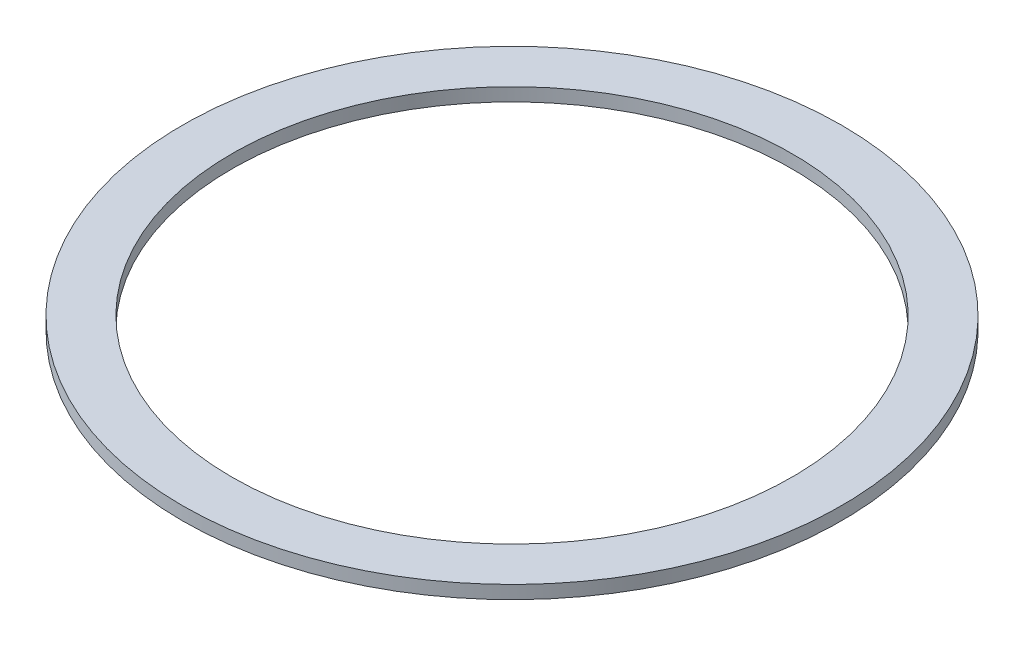
ISO-10303-21;
HEADER;
FILE_DESCRIPTION(('STEP AP214'),'2;1');
FILE_NAME('part.step','',(''),(''),'','','');
FILE_SCHEMA(('AUTOMOTIVE_DESIGN { 1 0 10303 214 1 1 1 1 }'));
ENDSEC;
DATA;
#1=APPLICATION_CONTEXT('core data for automotive mechanical design processes');
#2=APPLICATION_PROTOCOL_DEFINITION('international standard','automotive_design',2000,#1);
#3=PRODUCT_CONTEXT('',#1,'mechanical');
#4=PRODUCT('Part','Part','',(#3));
#5=PRODUCT_RELATED_PRODUCT_CATEGORY('part','',(#4));
#6=PRODUCT_DEFINITION_FORMATION('','',#4);
#7=PRODUCT_DEFINITION_CONTEXT('part definition',#1,'design');
#8=PRODUCT_DEFINITION('design','',#6,#7);
#9=PRODUCT_DEFINITION_SHAPE('','',#8);
#10=(LENGTH_UNIT() NAMED_UNIT(*) SI_UNIT(.MILLI.,.METRE.));
#11=(NAMED_UNIT(*) PLANE_ANGLE_UNIT() SI_UNIT($,.RADIAN.));
#12=(NAMED_UNIT(*) SI_UNIT($,.STERADIAN.) SOLID_ANGLE_UNIT());
#13=UNCERTAINTY_MEASURE_WITH_UNIT(LENGTH_MEASURE(1.E-05),#10,'distance_accuracy_value','');
#14=(GEOMETRIC_REPRESENTATION_CONTEXT(3) GLOBAL_UNCERTAINTY_ASSIGNED_CONTEXT((#13)) GLOBAL_UNIT_ASSIGNED_CONTEXT((#10,
#11,#12)) REPRESENTATION_CONTEXT('',''));
#15=CARTESIAN_POINT('',(0.,0.,0.));
#16=DIRECTION('',(0.,0.,1.));
#17=DIRECTION('',(1.,0.,0.));
#18=AXIS2_PLACEMENT_3D('',#15,#16,#17);
#19=CARTESIAN_POINT('',(0.,4.,0.));
#20=DIRECTION('',(0.,1.,0.));
#21=DIRECTION('',(0.,0.,1.));
#22=AXIS2_PLACEMENT_3D('',#19,#20,#21);
#23=PLANE('',#22);
#24=CARTESIAN_POINT('',(0.,4.,0.));
#25=DIRECTION('',(0.,1.,0.));
#26=DIRECTION('',(0.,0.,1.));
#27=AXIS2_PLACEMENT_3D('',#24,#25,#26);
#28=CIRCLE('',#27,100.);
#29=CARTESIAN_POINT('',(0.,4.,100.));
#30=VERTEX_POINT('',#29);
#31=EDGE_CURVE('E10',#30,#30,#28,.T.);
#32=ORIENTED_EDGE('',*,*,#31,.T.);
#33=EDGE_LOOP('',(#32));
#34=FACE_BOUND('',#33,.T.);
#35=CARTESIAN_POINT('',(0.,4.,0.));
#36=DIRECTION('',(0.,1.,0.));
#37=DIRECTION('',(0.,0.,1.));
#38=AXIS2_PLACEMENT_3D('',#35,#36,#37);
#39=CIRCLE('',#38,85.);
#40=CARTESIAN_POINT('',(0.,4.,85.));
#41=VERTEX_POINT('',#40);
#42=EDGE_CURVE('E43',#41,#41,#39,.T.);
#43=ORIENTED_EDGE('',*,*,#42,.F.);
#44=EDGE_LOOP('',(#43));
#45=FACE_BOUND('',#44,.T.);
#46=ADVANCED_FACE('F32',(#34,#45),#23,.T.);
#47=CARTESIAN_POINT('',(0.,0.,0.));
#48=DIRECTION('',(0.,1.,0.));
#49=DIRECTION('',(0.,0.,1.));
#50=AXIS2_PLACEMENT_3D('',#47,#48,#49);
#51=PLANE('',#50);
#52=CARTESIAN_POINT('',(0.,0.,0.));
#53=DIRECTION('',(0.,1.,0.));
#54=DIRECTION('',(0.,0.,1.));
#55=AXIS2_PLACEMENT_3D('',#52,#53,#54);
#56=CIRCLE('',#55,100.);
#57=CARTESIAN_POINT('',(0.,0.,100.));
#58=VERTEX_POINT('',#57);
#59=EDGE_CURVE('E36',#58,#58,#56,.T.);
#60=ORIENTED_EDGE('',*,*,#59,.F.);
#61=EDGE_LOOP('',(#60));
#62=FACE_BOUND('',#61,.T.);
#63=CARTESIAN_POINT('',(0.,0.,0.));
#64=DIRECTION('',(0.,1.,0.));
#65=DIRECTION('',(0.,0.,1.));
#66=AXIS2_PLACEMENT_3D('',#63,#64,#65);
#67=CIRCLE('',#66,85.);
#68=CARTESIAN_POINT('',(0.,0.,85.));
#69=VERTEX_POINT('',#68);
#70=EDGE_CURVE('E45',#69,#69,#67,.T.);
#71=ORIENTED_EDGE('',*,*,#70,.T.);
#72=EDGE_LOOP('',(#71));
#73=FACE_BOUND('',#72,.T.);
#74=ADVANCED_FACE('F55',(#62,#73),#51,.F.);
#75=CARTESIAN_POINT('',(0.,4.,0.));
#76=DIRECTION('',(0.,-1.,0.));
#77=DIRECTION('',(0.,0.,-1.));
#78=AXIS2_PLACEMENT_3D('',#75,#76,#77);
#79=CYLINDRICAL_SURFACE('',#78,100.);
#80=ORIENTED_EDGE('',*,*,#31,.F.);
#81=EDGE_LOOP('',(#80));
#82=FACE_BOUND('',#81,.T.);
#83=ORIENTED_EDGE('',*,*,#59,.T.);
#84=EDGE_LOOP('',(#83));
#85=FACE_BOUND('',#84,.T.);
#86=ADVANCED_FACE('F34',(#82,#85),#79,.T.);
#87=CARTESIAN_POINT('',(0.,4.,0.));
#88=DIRECTION('',(0.,-1.,0.));
#89=DIRECTION('',(0.,0.,-1.));
#90=AXIS2_PLACEMENT_3D('',#87,#88,#89);
#91=CYLINDRICAL_SURFACE('',#90,85.);
#92=ORIENTED_EDGE('',*,*,#42,.T.);
#93=EDGE_LOOP('',(#92));
#94=FACE_BOUND('',#93,.T.);
#95=ORIENTED_EDGE('',*,*,#70,.F.);
#96=EDGE_LOOP('',(#95));
#97=FACE_BOUND('',#96,.T.);
#98=ADVANCED_FACE('F51',(#94,#97),#91,.F.);
#99=CLOSED_SHELL('',(#46,#74,#86,#98));
#100=MANIFOLD_SOLID_BREP('B2',#99);
#101=ADVANCED_BREP_SHAPE_REPRESENTATION('',(#18,#100),#14);
#102=SHAPE_DEFINITION_REPRESENTATION(#9,#101);
ENDSEC;
END-ISO-10303-21;
